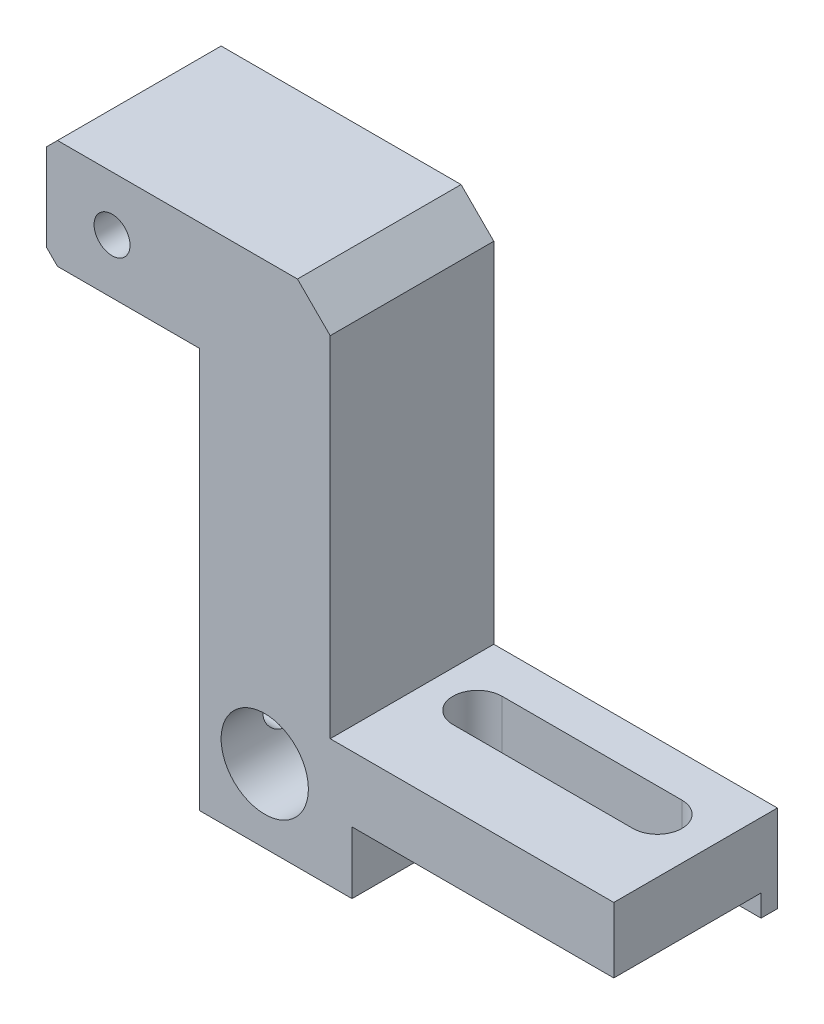
ISO-10303-21;
HEADER;
FILE_DESCRIPTION(('STEP AP214'),'2;1');
FILE_NAME('part.step','',(''),(''),'','','');
FILE_SCHEMA(('AUTOMOTIVE_DESIGN { 1 0 10303 214 1 1 1 1 }'));
ENDSEC;
DATA;
#1=APPLICATION_CONTEXT('core data for automotive mechanical design processes');
#2=APPLICATION_PROTOCOL_DEFINITION('international standard','automotive_design',2000,#1);
#3=PRODUCT_CONTEXT('',#1,'mechanical');
#4=PRODUCT('Part','Part','',(#3));
#5=PRODUCT_RELATED_PRODUCT_CATEGORY('part','',(#4));
#6=PRODUCT_DEFINITION_FORMATION('','',#4);
#7=PRODUCT_DEFINITION_CONTEXT('part definition',#1,'design');
#8=PRODUCT_DEFINITION('design','',#6,#7);
#9=PRODUCT_DEFINITION_SHAPE('','',#8);
#10=(LENGTH_UNIT() NAMED_UNIT(*) SI_UNIT(.MILLI.,.METRE.));
#11=(NAMED_UNIT(*) PLANE_ANGLE_UNIT() SI_UNIT($,.RADIAN.));
#12=(NAMED_UNIT(*) SI_UNIT($,.STERADIAN.) SOLID_ANGLE_UNIT());
#13=UNCERTAINTY_MEASURE_WITH_UNIT(LENGTH_MEASURE(1.E-05),#10,'distance_accuracy_value','');
#14=(GEOMETRIC_REPRESENTATION_CONTEXT(3) GLOBAL_UNCERTAINTY_ASSIGNED_CONTEXT((#13)) GLOBAL_UNIT_ASSIGNED_CONTEXT((#10,
#11,#12)) REPRESENTATION_CONTEXT('',''));
#15=CARTESIAN_POINT('',(0.,0.,0.));
#16=DIRECTION('',(0.,0.,1.));
#17=DIRECTION('',(1.,0.,0.));
#18=AXIS2_PLACEMENT_3D('',#15,#16,#17);
#19=CARTESIAN_POINT('',(32.2857142857143,-33.9081632653061,15.));
#20=DIRECTION('',(0.,1.,0.));
#21=DIRECTION('',(0.,0.,1.));
#22=AXIS2_PLACEMENT_3D('',#19,#20,#21);
#23=PLANE('',#22);
#24=DIRECTION('',(-1.,0.,0.));
#25=VECTOR('',#24,1.);
#26=CARTESIAN_POINT('',(32.2857142857143,-33.9081632653061,3.75));
#27=LINE('',#26,#25);
#28=CARTESIAN_POINT('',(27.2857142857143,-33.9081632653061,3.75));
#29=VERTEX_POINT('',#28);
#30=CARTESIAN_POINT('',(10.7857142857143,-33.9081632653061,3.75000000000001));
#31=VERTEX_POINT('',#30);
#32=EDGE_CURVE('E398',#29,#31,#27,.T.);
#33=ORIENTED_EDGE('',*,*,#32,.T.);
#34=CARTESIAN_POINT('',(10.7857142857143,-33.9081632653061,6.00000000000001));
#35=DIRECTION('',(0.,1.,0.));
#36=DIRECTION('',(0.,0.,1.));
#37=AXIS2_PLACEMENT_3D('',#34,#35,#36);
#38=CIRCLE('',#37,2.25);
#39=CARTESIAN_POINT('',(10.7857142857143,-33.9081632653061,8.25));
#40=VERTEX_POINT('',#39);
#41=EDGE_CURVE('E387',#31,#40,#38,.T.);
#42=ORIENTED_EDGE('',*,*,#41,.T.);
#43=DIRECTION('',(1.,0.,0.));
#44=VECTOR('',#43,1.);
#45=CARTESIAN_POINT('',(32.2857142857143,-33.9081632653061,8.25));
#46=LINE('',#45,#44);
#47=CARTESIAN_POINT('',(27.2857142857143,-33.9081632653061,8.25));
#48=VERTEX_POINT('',#47);
#49=EDGE_CURVE('E403',#40,#48,#46,.T.);
#50=ORIENTED_EDGE('',*,*,#49,.T.);
#51=CARTESIAN_POINT('',(27.2857142857143,-33.9081632653061,6.));
#52=DIRECTION('',(0.,1.,0.));
#53=DIRECTION('',(0.,0.,1.));
#54=AXIS2_PLACEMENT_3D('',#51,#52,#53);
#55=CIRCLE('',#54,2.25);
#56=EDGE_CURVE('E400',#48,#29,#55,.T.);
#57=ORIENTED_EDGE('',*,*,#56,.T.);
#58=EDGE_LOOP('',(#33,#42,#50,#57));
#59=FACE_BOUND('',#58,.T.);
#60=DIRECTION('',(-1.,0.,0.));
#61=VECTOR('',#60,1.);
#62=CARTESIAN_POINT('',(32.2857142857143,-33.9081632653061,1.5));
#63=LINE('',#62,#61);
#64=CARTESIAN_POINT('',(32.2857142857143,-33.9081632653061,1.5));
#65=VERTEX_POINT('',#64);
#66=CARTESIAN_POINT('',(10.2857142857143,-33.9081632653061,1.5));
#67=VERTEX_POINT('',#66);
#68=EDGE_CURVE('E385',#65,#67,#63,.T.);
#69=ORIENTED_EDGE('',*,*,#68,.F.);
#70=DIRECTION('',(0.,0.,-1.));
#71=VECTOR('',#70,1.);
#72=CARTESIAN_POINT('',(32.2857142857143,-33.9081632653061,15.));
#73=LINE('',#72,#71);
#74=CARTESIAN_POINT('',(32.2857142857143,-33.9081632653061,15.));
#75=VERTEX_POINT('',#74);
#76=EDGE_CURVE('E305',#75,#65,#73,.T.);
#77=ORIENTED_EDGE('',*,*,#76,.F.);
#78=DIRECTION('',(1.,0.,0.));
#79=VECTOR('',#78,1.);
#80=CARTESIAN_POINT('',(32.2857142857143,-33.9081632653061,15.));
#81=LINE('',#80,#79);
#82=CARTESIAN_POINT('',(8.2857142857143,-33.9081632653061,15.));
#83=VERTEX_POINT('',#82);
#84=EDGE_CURVE('E362',#83,#75,#81,.T.);
#85=ORIENTED_EDGE('',*,*,#84,.F.);
#86=DIRECTION('',(0.,0.,-1.));
#87=VECTOR('',#86,1.);
#88=CARTESIAN_POINT('',(8.2857142857143,-33.9081632653061,15.));
#89=LINE('',#88,#87);
#90=CARTESIAN_POINT('',(8.2857142857143,-33.9081632653061,0.));
#91=VERTEX_POINT('',#90);
#92=EDGE_CURVE('E308',#83,#91,#89,.T.);
#93=ORIENTED_EDGE('',*,*,#92,.T.);
#94=DIRECTION('',(1.,0.,0.));
#95=VECTOR('',#94,1.);
#96=CARTESIAN_POINT('',(32.2857142857143,-33.9081632653061,0.));
#97=LINE('',#96,#95);
#98=CARTESIAN_POINT('',(10.2857142857143,-33.9081632653061,0.));
#99=VERTEX_POINT('',#98);
#100=EDGE_CURVE('E345',#91,#99,#97,.T.);
#101=ORIENTED_EDGE('',*,*,#100,.T.);
#102=DIRECTION('',(0.,0.,-1.));
#103=VECTOR('',#102,1.);
#104=CARTESIAN_POINT('',(10.2857142857143,-33.9081632653061,0.));
#105=LINE('',#104,#103);
#106=EDGE_CURVE('E382',#67,#99,#105,.T.);
#107=ORIENTED_EDGE('',*,*,#106,.F.);
#108=EDGE_LOOP('',(#69,#77,#85,#93,#101,#107));
#109=FACE_BOUND('',#108,.T.);
#110=ADVANCED_FACE('F35',(#59,#109),#23,.F.);
#111=CARTESIAN_POINT('',(0.,0.,15.));
#112=DIRECTION('',(0.,0.,-1.));
#113=DIRECTION('',(-1.,0.,0.));
#114=AXIS2_PLACEMENT_3D('',#111,#112,#113);
#115=PLANE('',#114);
#116=CARTESIAN_POINT('',(-13.7142857142857,2.09183673469387,15.));
#117=DIRECTION('',(0.,0.,1.));
#118=DIRECTION('',(1.,0.,0.));
#119=AXIS2_PLACEMENT_3D('',#116,#117,#118);
#120=CIRCLE('',#119,1.64999999999999);
#121=CARTESIAN_POINT('',(-12.0642857142857,2.09183673469387,15.));
#122=VERTEX_POINT('',#121);
#123=EDGE_CURVE('E184',#122,#122,#120,.T.);
#124=ORIENTED_EDGE('',*,*,#123,.F.);
#125=EDGE_LOOP('',(#124));
#126=FACE_BOUND('',#125,.T.);
#127=DIRECTION('',(0.,1.,0.));
#128=VECTOR('',#127,1.);
#129=CARTESIAN_POINT('',(6.2857142857143,7.09183673469387,15.));
#130=LINE('',#129,#128);
#131=CARTESIAN_POINT('',(6.2857142857143,-27.9081632653061,15.));
#132=VERTEX_POINT('',#131);
#133=CARTESIAN_POINT('',(6.2857142857143,4.09183673469386,15.));
#134=VERTEX_POINT('',#133);
#135=EDGE_CURVE('E356',#132,#134,#130,.T.);
#136=ORIENTED_EDGE('',*,*,#135,.T.);
#137=DIRECTION('',(0.707106781186547,-0.707106781186548,0.));
#138=VECTOR('',#137,1.);
#139=CARTESIAN_POINT('',(3.28571428571429,7.09183673469387,15.));
#140=LINE('',#139,#138);
#141=CARTESIAN_POINT('',(3.28571428571429,7.09183673469387,15.));
#142=VERTEX_POINT('',#141);
#143=EDGE_CURVE('E11',#134,#142,#140,.F.);
#144=ORIENTED_EDGE('',*,*,#143,.T.);
#145=DIRECTION('',(-1.,0.,0.));
#146=VECTOR('',#145,1.);
#147=CARTESIAN_POINT('',(-19.7142857142857,7.09183673469387,15.));
#148=LINE('',#147,#146);
#149=CARTESIAN_POINT('',(-18.7142857142857,7.09183673469387,15.));
#150=VERTEX_POINT('',#149);
#151=EDGE_CURVE('E285',#142,#150,#148,.T.);
#152=ORIENTED_EDGE('',*,*,#151,.T.);
#153=DIRECTION('',(0.70710678118655,0.707106781186545,0.));
#154=VECTOR('',#153,1.);
#155=CARTESIAN_POINT('',(-19.7142857142857,6.09183673469388,15.));
#156=LINE('',#155,#154);
#157=CARTESIAN_POINT('',(-19.7142857142857,6.09183673469388,15.));
#158=VERTEX_POINT('',#157);
#159=EDGE_CURVE('E260',#150,#158,#156,.F.);
#160=ORIENTED_EDGE('',*,*,#159,.T.);
#161=DIRECTION('',(0.,-1.,0.));
#162=VECTOR('',#161,1.);
#163=CARTESIAN_POINT('',(-19.7142857142857,-2.90816326530613,15.));
#164=LINE('',#163,#162);
#165=CARTESIAN_POINT('',(-19.7142857142857,-1.90816326530613,15.));
#166=VERTEX_POINT('',#165);
#167=EDGE_CURVE('E290',#158,#166,#164,.T.);
#168=ORIENTED_EDGE('',*,*,#167,.T.);
#169=DIRECTION('',(-0.707106781186545,0.70710678118655,0.));
#170=VECTOR('',#169,1.);
#171=CARTESIAN_POINT('',(-18.7142857142857,-2.90816326530613,15.));
#172=LINE('',#171,#170);
#173=CARTESIAN_POINT('',(-18.7142857142857,-2.90816326530613,15.));
#174=VERTEX_POINT('',#173);
#175=EDGE_CURVE('E268',#166,#174,#172,.F.);
#176=ORIENTED_EDGE('',*,*,#175,.T.);
#177=DIRECTION('',(1.,0.,0.));
#178=VECTOR('',#177,1.);
#179=CARTESIAN_POINT('',(-5.7142857142857,-2.90816326530613,15.));
#180=LINE('',#179,#178);
#181=CARTESIAN_POINT('',(-5.7142857142857,-2.90816326530613,15.));
#182=VERTEX_POINT('',#181);
#183=EDGE_CURVE('E293',#174,#182,#180,.T.);
#184=ORIENTED_EDGE('',*,*,#183,.T.);
#185=DIRECTION('',(0.,-1.,0.));
#186=VECTOR('',#185,1.);
#187=CARTESIAN_POINT('',(-5.7142857142857,-39.6081632653061,15.));
#188=LINE('',#187,#186);
#189=CARTESIAN_POINT('',(-5.7142857142857,-39.6081632653061,15.));
#190=VERTEX_POINT('',#189);
#191=EDGE_CURVE('E368',#182,#190,#188,.T.);
#192=ORIENTED_EDGE('',*,*,#191,.T.);
#193=DIRECTION('',(1.,0.,0.));
#194=VECTOR('',#193,1.);
#195=CARTESIAN_POINT('',(8.2857142857143,-39.6081632653061,15.));
#196=LINE('',#195,#194);
#197=CARTESIAN_POINT('',(8.2857142857143,-39.6081632653061,15.));
#198=VERTEX_POINT('',#197);
#199=EDGE_CURVE('E366',#190,#198,#196,.T.);
#200=ORIENTED_EDGE('',*,*,#199,.T.);
#201=DIRECTION('',(0.,1.,0.));
#202=VECTOR('',#201,1.);
#203=CARTESIAN_POINT('',(8.2857142857143,-33.9081632653061,15.));
#204=LINE('',#203,#202);
#205=EDGE_CURVE('E364',#198,#83,#204,.T.);
#206=ORIENTED_EDGE('',*,*,#205,.T.);
#207=ORIENTED_EDGE('',*,*,#84,.T.);
#208=DIRECTION('',(0.,1.,0.));
#209=VECTOR('',#208,1.);
#210=CARTESIAN_POINT('',(32.2857142857143,-27.9081632653061,15.));
#211=LINE('',#210,#209);
#212=CARTESIAN_POINT('',(32.2857142857143,-27.9081632653061,15.));
#213=VERTEX_POINT('',#212);
#214=EDGE_CURVE('E358',#75,#213,#211,.T.);
#215=ORIENTED_EDGE('',*,*,#214,.T.);
#216=DIRECTION('',(-1.,0.,0.));
#217=VECTOR('',#216,1.);
#218=CARTESIAN_POINT('',(6.2857142857143,-27.9081632653061,15.));
#219=LINE('',#218,#217);
#220=EDGE_CURVE('E357',#213,#132,#219,.T.);
#221=ORIENTED_EDGE('',*,*,#220,.T.);
#222=EDGE_LOOP('',(#136,#144,#152,#160,#168,#176,#184,#192,#200,#206,#207,#215,#221));
#223=FACE_BOUND('',#222,.T.);
#224=CARTESIAN_POINT('',(0.285714285714299,-32.9081632653061,15.));
#225=DIRECTION('',(0.,0.,1.));
#226=DIRECTION('',(1.,0.,0.));
#227=AXIS2_PLACEMENT_3D('',#224,#225,#226);
#228=CIRCLE('',#227,4.);
#229=CARTESIAN_POINT('',(4.2857142857143,-32.9081632653061,15.));
#230=VERTEX_POINT('',#229);
#231=EDGE_CURVE('E330',#230,#230,#228,.T.);
#232=ORIENTED_EDGE('',*,*,#231,.F.);
#233=EDGE_LOOP('',(#232));
#234=FACE_BOUND('',#233,.T.);
#235=ADVANCED_FACE('F217',(#126,#223,#234),#115,.F.);
#236=CARTESIAN_POINT('',(0.,0.,0.));
#237=DIRECTION('',(0.,0.,-1.));
#238=DIRECTION('',(-1.,0.,0.));
#239=AXIS2_PLACEMENT_3D('',#236,#237,#238);
#240=PLANE('',#239);
#241=DIRECTION('',(-1.,0.,0.));
#242=VECTOR('',#241,1.);
#243=CARTESIAN_POINT('',(-19.7142857142857,7.09183673469387,0.));
#244=LINE('',#243,#242);
#245=CARTESIAN_POINT('',(3.28571428571429,7.09183673469387,0.));
#246=VERTEX_POINT('',#245);
#247=CARTESIAN_POINT('',(-18.7142857142857,7.09183673469387,0.));
#248=VERTEX_POINT('',#247);
#249=EDGE_CURVE('E283',#246,#248,#244,.T.);
#250=ORIENTED_EDGE('',*,*,#249,.F.);
#251=DIRECTION('',(-0.707106781186547,0.707106781186548,0.));
#252=VECTOR('',#251,1.);
#253=CARTESIAN_POINT('',(5.18877551020408,5.18877551020408,0.));
#254=LINE('',#253,#252);
#255=CARTESIAN_POINT('',(6.2857142857143,4.09183673469386,0.));
#256=VERTEX_POINT('',#255);
#257=EDGE_CURVE('E57',#246,#256,#254,.F.);
#258=ORIENTED_EDGE('',*,*,#257,.T.);
#259=DIRECTION('',(0.,1.,0.));
#260=VECTOR('',#259,1.);
#261=CARTESIAN_POINT('',(6.2857142857143,7.09183673469387,0.));
#262=LINE('',#261,#260);
#263=CARTESIAN_POINT('',(6.2857142857143,-27.9081632653061,0.));
#264=VERTEX_POINT('',#263);
#265=EDGE_CURVE('E291',#264,#256,#262,.T.);
#266=ORIENTED_EDGE('',*,*,#265,.F.);
#267=DIRECTION('',(-1.,0.,0.));
#268=VECTOR('',#267,1.);
#269=CARTESIAN_POINT('',(6.2857142857143,-27.9081632653061,0.));
#270=LINE('',#269,#268);
#271=CARTESIAN_POINT('',(32.2857142857143,-27.9081632653061,0.));
#272=VERTEX_POINT('',#271);
#273=EDGE_CURVE('E295',#272,#264,#270,.T.);
#274=ORIENTED_EDGE('',*,*,#273,.F.);
#275=DIRECTION('',(0.,1.,0.));
#276=VECTOR('',#275,1.);
#277=CARTESIAN_POINT('',(32.2857142857143,-27.9081632653061,0.));
#278=LINE('',#277,#276);
#279=CARTESIAN_POINT('',(32.2857142857143,-35.9081632653061,0.));
#280=VERTEX_POINT('',#279);
#281=EDGE_CURVE('E348',#280,#272,#278,.T.);
#282=ORIENTED_EDGE('',*,*,#281,.F.);
#283=DIRECTION('',(1.,0.,0.));
#284=VECTOR('',#283,1.);
#285=CARTESIAN_POINT('',(32.2857142857143,-35.9081632653061,0.));
#286=LINE('',#285,#284);
#287=CARTESIAN_POINT('',(10.2857142857143,-35.9081632653061,0.));
#288=VERTEX_POINT('',#287);
#289=EDGE_CURVE('E381',#288,#280,#286,.T.);
#290=ORIENTED_EDGE('',*,*,#289,.F.);
#291=DIRECTION('',(0.,1.,0.));
#292=VECTOR('',#291,1.);
#293=CARTESIAN_POINT('',(10.2857142857143,-35.9081632653061,0.));
#294=LINE('',#293,#292);
#295=EDGE_CURVE('E378',#288,#99,#294,.T.);
#296=ORIENTED_EDGE('',*,*,#295,.T.);
#297=ORIENTED_EDGE('',*,*,#100,.F.);
#298=DIRECTION('',(0.,1.,0.));
#299=VECTOR('',#298,1.);
#300=CARTESIAN_POINT('',(8.2857142857143,-33.9081632653061,0.));
#301=LINE('',#300,#299);
#302=CARTESIAN_POINT('',(8.2857142857143,-39.6081632653061,0.));
#303=VERTEX_POINT('',#302);
#304=EDGE_CURVE('E343',#303,#91,#301,.T.);
#305=ORIENTED_EDGE('',*,*,#304,.F.);
#306=DIRECTION('',(1.,0.,0.));
#307=VECTOR('',#306,1.);
#308=CARTESIAN_POINT('',(8.2857142857143,-39.6081632653061,0.));
#309=LINE('',#308,#307);
#310=CARTESIAN_POINT('',(-5.7142857142857,-39.6081632653061,0.));
#311=VERTEX_POINT('',#310);
#312=EDGE_CURVE('E341',#311,#303,#309,.T.);
#313=ORIENTED_EDGE('',*,*,#312,.F.);
#314=DIRECTION('',(0.,-1.,0.));
#315=VECTOR('',#314,1.);
#316=CARTESIAN_POINT('',(-5.7142857142857,-39.6081632653061,0.));
#317=LINE('',#316,#315);
#318=CARTESIAN_POINT('',(-5.7142857142857,-2.90816326530613,0.));
#319=VERTEX_POINT('',#318);
#320=EDGE_CURVE('E332',#319,#311,#317,.T.);
#321=ORIENTED_EDGE('',*,*,#320,.F.);
#322=DIRECTION('',(1.,0.,0.));
#323=VECTOR('',#322,1.);
#324=CARTESIAN_POINT('',(-5.7142857142857,-2.90816326530613,0.));
#325=LINE('',#324,#323);
#326=CARTESIAN_POINT('',(-18.7142857142857,-2.90816326530613,0.));
#327=VERTEX_POINT('',#326);
#328=EDGE_CURVE('E329',#327,#319,#325,.T.);
#329=ORIENTED_EDGE('',*,*,#328,.F.);
#330=DIRECTION('',(0.707106781186545,-0.70710678118655,0.));
#331=VECTOR('',#330,1.);
#332=CARTESIAN_POINT('',(-10.811224489796,-10.8112244897959,0.));
#333=LINE('',#332,#331);
#334=CARTESIAN_POINT('',(-19.7142857142857,-1.90816326530613,0.));
#335=VERTEX_POINT('',#334);
#336=EDGE_CURVE('E324',#327,#335,#333,.F.);
#337=ORIENTED_EDGE('',*,*,#336,.T.);
#338=DIRECTION('',(0.,-1.,0.));
#339=VECTOR('',#338,1.);
#340=CARTESIAN_POINT('',(-19.7142857142857,-2.90816326530613,0.));
#341=LINE('',#340,#339);
#342=CARTESIAN_POINT('',(-19.7142857142857,6.09183673469388,0.));
#343=VERTEX_POINT('',#342);
#344=EDGE_CURVE('E326',#343,#335,#341,.T.);
#345=ORIENTED_EDGE('',*,*,#344,.F.);
#346=DIRECTION('',(-0.70710678118655,-0.707106781186545,0.));
#347=VECTOR('',#346,1.);
#348=CARTESIAN_POINT('',(-12.9030612244897,12.9030612244898,0.));
#349=LINE('',#348,#347);
#350=EDGE_CURVE('E289',#343,#248,#349,.F.);
#351=ORIENTED_EDGE('',*,*,#350,.T.);
#352=EDGE_LOOP('',(#250,#258,#266,#274,#282,#290,#296,#297,#305,#313,#321,#329,#337,#345,#351));
#353=FACE_BOUND('',#352,.T.);
#354=CARTESIAN_POINT('',(0.285714285714299,-32.9081632653061,0.));
#355=DIRECTION('',(0.,0.,1.));
#356=DIRECTION('',(1.,0.,0.));
#357=AXIS2_PLACEMENT_3D('',#354,#355,#356);
#358=CIRCLE('',#357,4.);
#359=CARTESIAN_POINT('',(4.2857142857143,-32.9081632653061,0.));
#360=VERTEX_POINT('',#359);
#361=EDGE_CURVE('E335',#360,#360,#358,.T.);
#362=ORIENTED_EDGE('',*,*,#361,.T.);
#363=EDGE_LOOP('',(#362));
#364=FACE_BOUND('',#363,.T.);
#365=ADVANCED_FACE('F223',(#353,#364),#240,.T.);
#366=CARTESIAN_POINT('',(-19.7142857142857,-2.90816326530613,15.));
#367=DIRECTION('',(1.,0.,0.));
#368=DIRECTION('',(0.,0.,-1.));
#369=AXIS2_PLACEMENT_3D('',#366,#367,#368);
#370=PLANE('',#369);
#371=ORIENTED_EDGE('',*,*,#344,.T.);
#372=DIRECTION('',(0.,0.,1.));
#373=VECTOR('',#372,1.);
#374=CARTESIAN_POINT('',(-19.7142857142857,-1.90816326530613,15.));
#375=LINE('',#374,#373);
#376=EDGE_CURVE('E269',#335,#166,#375,.T.);
#377=ORIENTED_EDGE('',*,*,#376,.T.);
#378=ORIENTED_EDGE('',*,*,#167,.F.);
#379=DIRECTION('',(0.,0.,-1.));
#380=VECTOR('',#379,1.);
#381=CARTESIAN_POINT('',(-19.7142857142857,6.09183673469388,15.));
#382=LINE('',#381,#380);
#383=EDGE_CURVE('E264',#158,#343,#382,.T.);
#384=ORIENTED_EDGE('',*,*,#383,.T.);
#385=EDGE_LOOP('',(#371,#377,#378,#384));
#386=FACE_BOUND('',#385,.T.);
#387=ADVANCED_FACE('F247',(#386),#370,.F.);
#388=CARTESIAN_POINT('',(-5.7142857142857,-2.90816326530613,15.));
#389=DIRECTION('',(0.,1.,0.));
#390=DIRECTION('',(-1.,0.,0.));
#391=AXIS2_PLACEMENT_3D('',#388,#389,#390);
#392=PLANE('',#391);
#393=ORIENTED_EDGE('',*,*,#183,.F.);
#394=DIRECTION('',(0.,0.,-1.));
#395=VECTOR('',#394,1.);
#396=CARTESIAN_POINT('',(-18.7142857142857,-2.90816326530613,15.));
#397=LINE('',#396,#395);
#398=EDGE_CURVE('E320',#174,#327,#397,.T.);
#399=ORIENTED_EDGE('',*,*,#398,.T.);
#400=ORIENTED_EDGE('',*,*,#328,.T.);
#401=DIRECTION('',(0.,0.,-1.));
#402=VECTOR('',#401,1.);
#403=CARTESIAN_POINT('',(-5.7142857142857,-2.90816326530613,15.));
#404=LINE('',#403,#402);
#405=EDGE_CURVE('E317',#182,#319,#404,.T.);
#406=ORIENTED_EDGE('',*,*,#405,.F.);
#407=EDGE_LOOP('',(#393,#399,#400,#406));
#408=FACE_BOUND('',#407,.T.);
#409=ADVANCED_FACE('F243',(#408),#392,.F.);
#410=CARTESIAN_POINT('',(-5.7142857142857,-39.6081632653061,15.));
#411=DIRECTION('',(1.,0.,0.));
#412=DIRECTION('',(0.,1.,0.));
#413=AXIS2_PLACEMENT_3D('',#410,#411,#412);
#414=PLANE('',#413);
#415=CARTESIAN_POINT('',(-5.7142857142857,-32.9081632653061,9.5));
#416=DIRECTION('',(-1.,0.,0.));
#417=DIRECTION('',(0.,0.,1.));
#418=AXIS2_PLACEMENT_3D('',#415,#416,#417);
#419=CIRCLE('',#418,1.64999999999998);
#420=CARTESIAN_POINT('',(-5.7142857142857,-32.9081632653061,11.15));
#421=VERTEX_POINT('',#420);
#422=EDGE_CURVE('E183',#421,#421,#419,.T.);
#423=ORIENTED_EDGE('',*,*,#422,.F.);
#424=EDGE_LOOP('',(#423));
#425=FACE_BOUND('',#424,.T.);
#426=ORIENTED_EDGE('',*,*,#320,.T.);
#427=DIRECTION('',(0.,0.,-1.));
#428=VECTOR('',#427,1.);
#429=CARTESIAN_POINT('',(-5.7142857142857,-39.6081632653061,15.));
#430=LINE('',#429,#428);
#431=EDGE_CURVE('E314',#190,#311,#430,.T.);
#432=ORIENTED_EDGE('',*,*,#431,.F.);
#433=ORIENTED_EDGE('',*,*,#191,.F.);
#434=ORIENTED_EDGE('',*,*,#405,.T.);
#435=EDGE_LOOP('',(#426,#432,#433,#434));
#436=FACE_BOUND('',#435,.T.);
#437=ADVANCED_FACE('F239',(#425,#436),#414,.F.);
#438=CARTESIAN_POINT('',(8.2857142857143,-39.6081632653061,15.));
#439=DIRECTION('',(0.,1.,0.));
#440=DIRECTION('',(0.,0.,1.));
#441=AXIS2_PLACEMENT_3D('',#438,#439,#440);
#442=PLANE('',#441);
#443=ORIENTED_EDGE('',*,*,#312,.T.);
#444=DIRECTION('',(0.,0.,-1.));
#445=VECTOR('',#444,1.);
#446=CARTESIAN_POINT('',(8.2857142857143,-39.6081632653061,15.));
#447=LINE('',#446,#445);
#448=EDGE_CURVE('E311',#198,#303,#447,.T.);
#449=ORIENTED_EDGE('',*,*,#448,.F.);
#450=ORIENTED_EDGE('',*,*,#199,.F.);
#451=ORIENTED_EDGE('',*,*,#431,.T.);
#452=EDGE_LOOP('',(#443,#449,#450,#451));
#453=FACE_BOUND('',#452,.T.);
#454=ADVANCED_FACE('F235',(#453),#442,.F.);
#455=CARTESIAN_POINT('',(8.2857142857143,-33.9081632653061,15.));
#456=DIRECTION('',(-1.,0.,0.));
#457=DIRECTION('',(0.,0.,1.));
#458=AXIS2_PLACEMENT_3D('',#455,#456,#457);
#459=PLANE('',#458);
#460=ORIENTED_EDGE('',*,*,#304,.T.);
#461=ORIENTED_EDGE('',*,*,#92,.F.);
#462=ORIENTED_EDGE('',*,*,#205,.F.);
#463=ORIENTED_EDGE('',*,*,#448,.T.);
#464=EDGE_LOOP('',(#460,#461,#462,#463));
#465=FACE_BOUND('',#464,.T.);
#466=ADVANCED_FACE('F232',(#465),#459,.F.);
#467=CARTESIAN_POINT('',(32.2857142857143,-27.9081632653061,15.));
#468=DIRECTION('',(-1.,0.,0.));
#469=DIRECTION('',(0.,0.,1.));
#470=AXIS2_PLACEMENT_3D('',#467,#468,#469);
#471=PLANE('',#470);
#472=ORIENTED_EDGE('',*,*,#281,.T.);
#473=DIRECTION('',(0.,0.,-1.));
#474=VECTOR('',#473,1.);
#475=CARTESIAN_POINT('',(32.2857142857143,-27.9081632653061,15.));
#476=LINE('',#475,#474);
#477=EDGE_CURVE('E302',#213,#272,#476,.T.);
#478=ORIENTED_EDGE('',*,*,#477,.F.);
#479=ORIENTED_EDGE('',*,*,#214,.F.);
#480=ORIENTED_EDGE('',*,*,#76,.T.);
#481=DIRECTION('',(0.,1.,0.));
#482=VECTOR('',#481,1.);
#483=CARTESIAN_POINT('',(32.2857142857143,-35.9081632653061,1.5));
#484=LINE('',#483,#482);
#485=CARTESIAN_POINT('',(32.2857142857143,-35.9081632653061,1.5));
#486=VERTEX_POINT('',#485);
#487=EDGE_CURVE('E372',#486,#65,#484,.T.);
#488=ORIENTED_EDGE('',*,*,#487,.F.);
#489=DIRECTION('',(0.,0.,1.));
#490=VECTOR('',#489,1.);
#491=CARTESIAN_POINT('',(32.2857142857143,-35.9081632653061,0.));
#492=LINE('',#491,#490);
#493=EDGE_CURVE('E384',#280,#486,#492,.T.);
#494=ORIENTED_EDGE('',*,*,#493,.F.);
#495=EDGE_LOOP('',(#472,#478,#479,#480,#488,#494));
#496=FACE_BOUND('',#495,.T.);
#497=ADVANCED_FACE('F230',(#496),#471,.F.);
#498=CARTESIAN_POINT('',(6.2857142857143,-27.9081632653061,15.));
#499=DIRECTION('',(0.,-1.,0.));
#500=DIRECTION('',(0.,0.,-1.));
#501=AXIS2_PLACEMENT_3D('',#498,#499,#500);
#502=PLANE('',#501);
#503=DIRECTION('',(1.,0.,0.));
#504=VECTOR('',#503,1.);
#505=CARTESIAN_POINT('',(10.7857142857143,-27.9081632653061,8.25));
#506=LINE('',#505,#504);
#507=CARTESIAN_POINT('',(10.7857142857143,-27.9081632653061,8.25));
#508=VERTEX_POINT('',#507);
#509=CARTESIAN_POINT('',(27.2857142857143,-27.9081632653061,8.25));
#510=VERTEX_POINT('',#509);
#511=EDGE_CURVE('E420',#508,#510,#506,.T.);
#512=ORIENTED_EDGE('',*,*,#511,.F.);
#513=CARTESIAN_POINT('',(10.7857142857143,-27.9081632653061,6.00000000000001));
#514=DIRECTION('',(0.,1.,0.));
#515=DIRECTION('',(0.,0.,1.));
#516=AXIS2_PLACEMENT_3D('',#513,#514,#515);
#517=CIRCLE('',#516,2.25);
#518=CARTESIAN_POINT('',(10.7857142857143,-27.9081632653061,3.75000000000001));
#519=VERTEX_POINT('',#518);
#520=EDGE_CURVE('E198',#519,#508,#517,.T.);
#521=ORIENTED_EDGE('',*,*,#520,.F.);
#522=DIRECTION('',(-1.,0.,0.));
#523=VECTOR('',#522,1.);
#524=CARTESIAN_POINT('',(10.7857142857143,-27.9081632653061,3.75000000000001));
#525=LINE('',#524,#523);
#526=CARTESIAN_POINT('',(27.2857142857143,-27.9081632653061,3.75));
#527=VERTEX_POINT('',#526);
#528=EDGE_CURVE('E411',#527,#519,#525,.T.);
#529=ORIENTED_EDGE('',*,*,#528,.F.);
#530=CARTESIAN_POINT('',(27.2857142857143,-27.9081632653061,6.));
#531=DIRECTION('',(0.,1.,0.));
#532=DIRECTION('',(0.,0.,1.));
#533=AXIS2_PLACEMENT_3D('',#530,#531,#532);
#534=CIRCLE('',#533,2.25);
#535=EDGE_CURVE('E418',#510,#527,#534,.T.);
#536=ORIENTED_EDGE('',*,*,#535,.F.);
#537=EDGE_LOOP('',(#512,#521,#529,#536));
#538=FACE_BOUND('',#537,.T.);
#539=ORIENTED_EDGE('',*,*,#273,.T.);
#540=DIRECTION('',(0.,0.,-1.));
#541=VECTOR('',#540,1.);
#542=CARTESIAN_POINT('',(6.2857142857143,-27.9081632653061,15.));
#543=LINE('',#542,#541);
#544=EDGE_CURVE('E299',#132,#264,#543,.T.);
#545=ORIENTED_EDGE('',*,*,#544,.F.);
#546=ORIENTED_EDGE('',*,*,#220,.F.);
#547=ORIENTED_EDGE('',*,*,#477,.T.);
#548=EDGE_LOOP('',(#539,#545,#546,#547));
#549=FACE_BOUND('',#548,.T.);
#550=ADVANCED_FACE('F352',(#538,#549),#502,.F.);
#551=CARTESIAN_POINT('',(6.2857142857143,7.09183673469387,15.));
#552=DIRECTION('',(-1.,0.,0.));
#553=DIRECTION('',(0.,-1.,0.));
#554=AXIS2_PLACEMENT_3D('',#551,#552,#553);
#555=PLANE('',#554);
#556=ORIENTED_EDGE('',*,*,#265,.T.);
#557=DIRECTION('',(0.,0.,1.));
#558=VECTOR('',#557,1.);
#559=CARTESIAN_POINT('',(6.2857142857143,4.09183673469386,15.));
#560=LINE('',#559,#558);
#561=EDGE_CURVE('E43',#256,#134,#560,.T.);
#562=ORIENTED_EDGE('',*,*,#561,.T.);
#563=ORIENTED_EDGE('',*,*,#135,.F.);
#564=ORIENTED_EDGE('',*,*,#544,.T.);
#565=EDGE_LOOP('',(#556,#562,#563,#564));
#566=FACE_BOUND('',#565,.T.);
#567=ADVANCED_FACE('F355',(#566),#555,.F.);
#568=CARTESIAN_POINT('',(-19.7142857142857,7.09183673469387,15.));
#569=DIRECTION('',(0.,-1.,0.));
#570=DIRECTION('',(1.,0.,0.));
#571=AXIS2_PLACEMENT_3D('',#568,#569,#570);
#572=PLANE('',#571);
#573=ORIENTED_EDGE('',*,*,#151,.F.);
#574=DIRECTION('',(0.,0.,-1.));
#575=VECTOR('',#574,1.);
#576=CARTESIAN_POINT('',(3.28571428571429,7.09183673469387,15.));
#577=LINE('',#576,#575);
#578=EDGE_CURVE('E276',#142,#246,#577,.T.);
#579=ORIENTED_EDGE('',*,*,#578,.T.);
#580=ORIENTED_EDGE('',*,*,#249,.T.);
#581=DIRECTION('',(0.,0.,1.));
#582=VECTOR('',#581,1.);
#583=CARTESIAN_POINT('',(-18.7142857142857,7.09183673469387,15.));
#584=LINE('',#583,#582);
#585=EDGE_CURVE('E262',#248,#150,#584,.T.);
#586=ORIENTED_EDGE('',*,*,#585,.T.);
#587=EDGE_LOOP('',(#573,#579,#580,#586));
#588=FACE_BOUND('',#587,.T.);
#589=ADVANCED_FACE('F282',(#588),#572,.F.);
#590=CARTESIAN_POINT('',(0.285714285714299,-32.9081632653061,15.));
#591=DIRECTION('',(0.,0.,-1.));
#592=DIRECTION('',(-1.,0.,0.));
#593=AXIS2_PLACEMENT_3D('',#590,#591,#592);
#594=CYLINDRICAL_SURFACE('',#593,4.);
#595=CARTESIAN_POINT('',(-3.7142857142857,-32.9081632653061,11.15));
#596=CARTESIAN_POINT('',(-3.71427881245644,-32.9966229436694,11.1499907827934));
#597=CARTESIAN_POINT('',(-3.71131717220742,-33.0852255173637,11.1428439856567));
#598=CARTESIAN_POINT('',(-3.69975684631121,-33.2599229351425,11.1145088580631));
#599=CARTESIAN_POINT('',(-3.69114329196177,-33.3460105373031,11.0932834889757));
#600=CARTESIAN_POINT('',(-3.66920536958506,-33.5128657622089,11.0377051877981));
#601=CARTESIAN_POINT('',(-3.65589683826781,-33.5936501997973,11.0033963566465));
#602=CARTESIAN_POINT('',(-3.62586857715102,-33.7482398985296,10.9228052421506));
#603=CARTESIAN_POINT('',(-3.60914991891815,-33.8220473414237,10.8765267188298));
#604=CARTESIAN_POINT('',(-3.57305471440719,-33.9643509612914,10.7708932453559));
#605=CARTESIAN_POINT('',(-3.55359225815828,-34.0324570048809,10.711042329751));
#606=CARTESIAN_POINT('',(-3.51458054775669,-34.1579990091537,10.581011160341));
#607=CARTESIAN_POINT('',(-3.49503125405193,-34.2154294545757,10.5108256007882));
#608=CARTESIAN_POINT('',(-3.45701123114637,-34.3207115333966,10.3580317511283));
#609=CARTESIAN_POINT('',(-3.43863731086663,-34.3679710832117,10.2749888846935));
#610=CARTESIAN_POINT('',(-3.40640707518957,-34.4476768473002,10.1012636907098));
#611=CARTESIAN_POINT('',(-3.39254847937685,-34.480130542434,10.010585248637));
#612=CARTESIAN_POINT('',(-3.37184593300193,-34.527700647531,9.82865200299816));
#613=CARTESIAN_POINT('',(-3.36470020531807,-34.5435669794777,9.73762892785692));
#614=CARTESIAN_POINT('',(-3.35736286224273,-34.5598524465141,9.55395349263471));
#615=CARTESIAN_POINT('',(-3.35716752001309,-34.5602798600461,9.46130203237069));
#616=CARTESIAN_POINT('',(-3.36349710008175,-34.5462410731044,9.28440111338127));
#617=CARTESIAN_POINT('',(-3.36952011169611,-34.5328872501807,9.20004184125083));
#618=CARTESIAN_POINT('',(-3.38676103680408,-34.4935281076181,9.03488971561882));
#619=CARTESIAN_POINT('',(-3.3979799221243,-34.467520421178,8.9540975323967));
#620=CARTESIAN_POINT('',(-3.42460029910002,-34.403087394731,8.79635489124137));
#621=CARTESIAN_POINT('',(-3.44008494612762,-34.3644119350363,8.71952126219166));
#622=CARTESIAN_POINT('',(-3.47347187665477,-34.2759177197424,8.57313976753996));
#623=CARTESIAN_POINT('',(-3.49137510155456,-34.2260946200877,8.50359475775084));
#624=CARTESIAN_POINT('',(-3.52938313824665,-34.1118823845548,8.36771359221219));
#625=CARTESIAN_POINT('',(-3.5495475968226,-34.04662956625,8.30211804229674));
#626=CARTESIAN_POINT('',(-3.58855482035923,-33.9058458201723,8.18255532555862));
#627=CARTESIAN_POINT('',(-3.607397287181,-33.8303125851535,8.12859077613916));
#628=CARTESIAN_POINT('',(-3.64216503700308,-33.6688996350434,8.03276522641496));
#629=CARTESIAN_POINT('',(-3.65801622145362,-33.5828273593784,7.99119971680583));
#630=CARTESIAN_POINT('',(-3.68444891245176,-33.4040915188591,7.92339697589113));
#631=CARTESIAN_POINT('',(-3.69503327122324,-33.3114315526785,7.89715144678884));
#632=CARTESIAN_POINT('',(-3.70921022066505,-33.1283445696238,7.86227049632178));
#633=CARTESIAN_POINT('',(-3.71319692574886,-33.0381374376143,7.85264082206407));
#634=CARTESIAN_POINT('',(-3.71498317855355,-32.8573158251539,7.84830795623671));
#635=CARTESIAN_POINT('',(-3.71278445799914,-32.7667014658055,7.85360058689179));
#636=CARTESIAN_POINT('',(-3.70270318512417,-32.5922555098186,7.87824526824297));
#637=CARTESIAN_POINT('',(-3.6951010311738,-32.5083079477794,7.8969040733401));
#638=CARTESIAN_POINT('',(-3.67527459231661,-32.3448227919765,7.94679209633712));
#639=CARTESIAN_POINT('',(-3.66304972072902,-32.265285759434,7.9780229098148));
#640=CARTESIAN_POINT('',(-3.63468300312034,-32.1101012893416,8.05318937998091));
#641=CARTESIAN_POINT('',(-3.61843157059426,-32.0346506086456,8.09748856175623));
#642=CARTESIAN_POINT('',(-3.58375339616118,-31.891984792097,8.19713393425788));
#643=CARTESIAN_POINT('',(-3.56532575562968,-31.824773081885,8.25248469508985));
#644=CARTESIAN_POINT('',(-3.5266886727311,-31.6955433223787,8.37720430481199));
#645=CARTESIAN_POINT('',(-3.50644487922402,-31.6342196196879,8.44728382403931));
#646=CARTESIAN_POINT('',(-3.46762500369401,-31.5240149104811,8.59707129060854));
#647=CARTESIAN_POINT('',(-3.44904927332679,-31.4751365236789,8.67678125994256));
#648=CARTESIAN_POINT('',(-3.41557271768413,-31.3907404423923,8.84509537053332));
#649=CARTESIAN_POINT('',(-3.40072295853066,-31.3554052359408,8.93380191600807));
#650=CARTESIAN_POINT('',(-3.37710211596752,-31.3004670836522,9.11670916597825));
#651=CARTESIAN_POINT('',(-3.36832615553506,-31.2808515135586,9.21090539641818));
#652=CARTESIAN_POINT('',(-3.3585813079381,-31.2591520259035,9.39443027315808));
#653=CARTESIAN_POINT('',(-3.35707145010094,-31.2558527716649,9.48358721945795));
#654=CARTESIAN_POINT('',(-3.36059749667474,-31.2636484117405,9.66112847075919));
#655=CARTESIAN_POINT('',(-3.36563244321267,-31.2747411996888,9.74951288691938));
#656=CARTESIAN_POINT('',(-3.3811906184727,-31.3099920852404,9.9189330712577));
#657=CARTESIAN_POINT('',(-3.39145832628821,-31.3335436809316,10.0001207114221));
#658=CARTESIAN_POINT('',(-3.41612982635155,-31.3924572705769,10.1574145224741));
#659=CARTESIAN_POINT('',(-3.43053477580741,-31.4278225693372,10.2335192642976));
#660=CARTESIAN_POINT('',(-3.46291980323731,-31.5117826427682,10.3834220382414));
#661=CARTESIAN_POINT('',(-3.48106149282573,-31.5610388293134,10.4568140710214));
#662=CARTESIAN_POINT('',(-3.5184143606528,-31.6704460839279,10.5946716872643));
#663=CARTESIAN_POINT('',(-3.53762589623627,-31.7306008075765,10.6591342627744));
#664=CARTESIAN_POINT('',(-3.57658743441759,-31.8651558777487,10.7819941387037));
#665=CARTESIAN_POINT('',(-3.59627930787797,-31.940263154576,10.8396392236055));
#666=CARTESIAN_POINT('',(-3.6326099833415,-32.0998198021241,10.9415401595387));
#667=CARTESIAN_POINT('',(-3.6492473875125,-32.1842734218633,10.9857898863659));
#668=CARTESIAN_POINT('',(-3.67734262822697,-32.3587485051965,11.0586637398347));
#669=CARTESIAN_POINT('',(-3.68888426850383,-32.4486498836567,11.0875424253585));
#670=CARTESIAN_POINT('',(-3.70583010204046,-32.6324440360929,11.1295110847851));
#671=CARTESIAN_POINT('',(-3.71125357578146,-32.7263232984881,11.1426506662454));
#672=CARTESIAN_POINT('',(-3.71396766055408,-32.8497189700789,11.14922677033));
#673=CARTESIAN_POINT('',(-3.71428799487409,-32.8789333166358,11.1500030456642));
#674=CARTESIAN_POINT('',(-3.7142857142857,-32.9081632653061,11.15));
#675=B_SPLINE_CURVE_WITH_KNOTS('',3,(#595,#596,#597,#598,#599,#600,#601,#602,#603,#604,#605,
#606,#607,#608,#609,#610,#611,#612,#613,#614,#615,#616,#617,#618,#619,#620,#621,#622,#623,#624,
#625,#626,#627,#628,#629,#630,#631,#632,#633,#634,#635,#636,#637,#638,#639,#640,#641,#642,#643,
#644,#645,#646,#647,#648,#649,#650,#651,#652,#653,#654,#655,#656,#657,#658,#659,#660,#661,#662,
#663,#664,#665,#666,#667,#668,#669,#670,#671,#672,#673,#674),.UNSPECIFIED.,.T.,.F.,(4,2,2,2,2,2,
2,2,2,2,2,2,2,2,2,2,2,2,2,2,2,2,2,2,2,2,2,2,2,2,2,2,2,2,2,2,2,2,2,4),(0.,0.265297098770629,
0.531294937906664,0.79640398149889,1.06142984766523,1.33841878994457,1.61555043582129,
1.90598404924537,2.19627075414925,2.47277648539421,2.7491339503796,3.00480633611683,
3.2605265616686,3.52163539301341,3.78284615202014,4.06565185095455,4.34852112528508,
4.63767392136374,4.92666995726767,5.19768149557685,5.46861716672805,5.72643264660553,
5.98428085748384,6.25011488704506,6.51605907418432,6.80064580250401,7.08529238632157,
7.3736498522578,7.66177550895674,7.92807823226722,8.19434198489783,8.44869772098558,
8.70312467109943,8.97267479984707,9.24231550885212,9.53104085816541,9.81989801073177,
10.1038095613048,10.3868238858898,10.4744866574817),.UNSPECIFIED.);
#676=CARTESIAN_POINT('',(-3.7142857142857,-32.9081632653061,11.15));
#677=VERTEX_POINT('',#676);
#678=EDGE_CURVE('E187',#677,#677,#675,.T.);
#679=ORIENTED_EDGE('',*,*,#678,.F.);
#680=EDGE_LOOP('',(#679));
#681=FACE_BOUND('',#680,.T.);
#682=ORIENTED_EDGE('',*,*,#231,.T.);
#683=EDGE_LOOP('',(#682));
#684=FACE_BOUND('',#683,.T.);
#685=ORIENTED_EDGE('',*,*,#361,.F.);
#686=EDGE_LOOP('',(#685));
#687=FACE_BOUND('',#686,.T.);
#688=ADVANCED_FACE('F459',(#681,#684,#687),#594,.F.);
#689=CARTESIAN_POINT('',(32.2857142857143,-35.9081632653061,1.5));
#690=DIRECTION('',(0.,0.,-1.));
#691=DIRECTION('',(-1.,0.,0.));
#692=AXIS2_PLACEMENT_3D('',#689,#690,#691);
#693=PLANE('',#692);
#694=ORIENTED_EDGE('',*,*,#68,.T.);
#695=DIRECTION('',(0.,1.,0.));
#696=VECTOR('',#695,1.);
#697=CARTESIAN_POINT('',(10.2857142857143,-35.9081632653061,1.5));
#698=LINE('',#697,#696);
#699=CARTESIAN_POINT('',(10.2857142857143,-35.9081632653061,1.5));
#700=VERTEX_POINT('',#699);
#701=EDGE_CURVE('E375',#700,#67,#698,.T.);
#702=ORIENTED_EDGE('',*,*,#701,.F.);
#703=DIRECTION('',(-1.,0.,0.));
#704=VECTOR('',#703,1.);
#705=CARTESIAN_POINT('',(32.2857142857143,-35.9081632653061,1.5));
#706=LINE('',#705,#704);
#707=EDGE_CURVE('E392',#486,#700,#706,.T.);
#708=ORIENTED_EDGE('',*,*,#707,.F.);
#709=ORIENTED_EDGE('',*,*,#487,.T.);
#710=EDGE_LOOP('',(#694,#702,#708,#709));
#711=FACE_BOUND('',#710,.T.);
#712=ADVANCED_FACE('F455',(#711),#693,.F.);
#713=CARTESIAN_POINT('',(10.2857142857143,-35.9081632653061,0.));
#714=DIRECTION('',(1.,0.,0.));
#715=DIRECTION('',(0.,0.,-1.));
#716=AXIS2_PLACEMENT_3D('',#713,#714,#715);
#717=PLANE('',#716);
#718=ORIENTED_EDGE('',*,*,#106,.T.);
#719=ORIENTED_EDGE('',*,*,#295,.F.);
#720=DIRECTION('',(0.,0.,-1.));
#721=VECTOR('',#720,1.);
#722=CARTESIAN_POINT('',(10.2857142857143,-35.9081632653061,0.));
#723=LINE('',#722,#721);
#724=EDGE_CURVE('E390',#700,#288,#723,.T.);
#725=ORIENTED_EDGE('',*,*,#724,.F.);
#726=ORIENTED_EDGE('',*,*,#701,.T.);
#727=EDGE_LOOP('',(#718,#719,#725,#726));
#728=FACE_BOUND('',#727,.T.);
#729=ADVANCED_FACE('F451',(#728),#717,.F.);
#730=CARTESIAN_POINT('',(0.,-35.9081632653061,0.));
#731=DIRECTION('',(0.,-1.,0.));
#732=DIRECTION('',(0.,0.,-1.));
#733=AXIS2_PLACEMENT_3D('',#730,#731,#732);
#734=PLANE('',#733);
#735=ORIENTED_EDGE('',*,*,#493,.T.);
#736=ORIENTED_EDGE('',*,*,#707,.T.);
#737=ORIENTED_EDGE('',*,*,#724,.T.);
#738=ORIENTED_EDGE('',*,*,#289,.T.);
#739=EDGE_LOOP('',(#735,#736,#737,#738));
#740=FACE_BOUND('',#739,.T.);
#741=ADVANCED_FACE('F444',(#740),#734,.T.);
#742=CARTESIAN_POINT('',(10.7857142857143,-39.6081632653061,6.00000000000001));
#743=DIRECTION('',(0.,1.,0.));
#744=DIRECTION('',(0.,0.,1.));
#745=AXIS2_PLACEMENT_3D('',#742,#743,#744);
#746=CYLINDRICAL_SURFACE('',#745,2.25);
#747=DIRECTION('',(0.,1.,0.));
#748=VECTOR('',#747,1.);
#749=CARTESIAN_POINT('',(10.7857142857143,-39.6081632653061,3.75000000000001));
#750=LINE('',#749,#748);
#751=EDGE_CURVE('E406',#31,#519,#750,.T.);
#752=ORIENTED_EDGE('',*,*,#751,.T.);
#753=ORIENTED_EDGE('',*,*,#520,.T.);
#754=DIRECTION('',(0.,1.,0.));
#755=VECTOR('',#754,1.);
#756=CARTESIAN_POINT('',(10.7857142857143,-39.6081632653061,8.25));
#757=LINE('',#756,#755);
#758=EDGE_CURVE('E407',#40,#508,#757,.T.);
#759=ORIENTED_EDGE('',*,*,#758,.F.);
#760=ORIENTED_EDGE('',*,*,#41,.F.);
#761=EDGE_LOOP('',(#752,#753,#759,#760));
#762=FACE_BOUND('',#761,.T.);
#763=ADVANCED_FACE('F428',(#762),#746,.F.);
#764=CARTESIAN_POINT('',(10.7857142857143,-39.6081632653061,3.75000000000001));
#765=DIRECTION('',(0.,0.,-1.));
#766=DIRECTION('',(-1.,0.,0.));
#767=AXIS2_PLACEMENT_3D('',#764,#765,#766);
#768=PLANE('',#767);
#769=DIRECTION('',(0.,1.,0.));
#770=VECTOR('',#769,1.);
#771=CARTESIAN_POINT('',(27.2857142857143,-39.6081632653061,3.75));
#772=LINE('',#771,#770);
#773=EDGE_CURVE('E413',#29,#527,#772,.T.);
#774=ORIENTED_EDGE('',*,*,#773,.T.);
#775=ORIENTED_EDGE('',*,*,#528,.T.);
#776=ORIENTED_EDGE('',*,*,#751,.F.);
#777=ORIENTED_EDGE('',*,*,#32,.F.);
#778=EDGE_LOOP('',(#774,#775,#776,#777));
#779=FACE_BOUND('',#778,.T.);
#780=ADVANCED_FACE('F437',(#779),#768,.F.);
#781=CARTESIAN_POINT('',(27.2857142857143,-39.6081632653061,6.));
#782=DIRECTION('',(0.,1.,0.));
#783=DIRECTION('',(0.,0.,1.));
#784=AXIS2_PLACEMENT_3D('',#781,#782,#783);
#785=CYLINDRICAL_SURFACE('',#784,2.25);
#786=DIRECTION('',(0.,1.,0.));
#787=VECTOR('',#786,1.);
#788=CARTESIAN_POINT('',(27.2857142857143,-39.6081632653061,8.25));
#789=LINE('',#788,#787);
#790=EDGE_CURVE('E410',#48,#510,#789,.T.);
#791=ORIENTED_EDGE('',*,*,#790,.T.);
#792=ORIENTED_EDGE('',*,*,#535,.T.);
#793=ORIENTED_EDGE('',*,*,#773,.F.);
#794=ORIENTED_EDGE('',*,*,#56,.F.);
#795=EDGE_LOOP('',(#791,#792,#793,#794));
#796=FACE_BOUND('',#795,.T.);
#797=ADVANCED_FACE('F434',(#796),#785,.F.);
#798=CARTESIAN_POINT('',(10.7857142857143,-39.6081632653061,8.25));
#799=DIRECTION('',(0.,0.,1.));
#800=DIRECTION('',(1.,0.,0.));
#801=AXIS2_PLACEMENT_3D('',#798,#799,#800);
#802=PLANE('',#801);
#803=ORIENTED_EDGE('',*,*,#758,.T.);
#804=ORIENTED_EDGE('',*,*,#511,.T.);
#805=ORIENTED_EDGE('',*,*,#790,.F.);
#806=ORIENTED_EDGE('',*,*,#49,.F.);
#807=EDGE_LOOP('',(#803,#804,#805,#806));
#808=FACE_BOUND('',#807,.T.);
#809=ADVANCED_FACE('F204',(#808),#802,.F.);
#810=CARTESIAN_POINT('',(-5.7142857142857,-32.9081632653061,9.5));
#811=DIRECTION('',(-1.,0.,0.));
#812=DIRECTION('',(0.,0.,1.));
#813=AXIS2_PLACEMENT_3D('',#810,#811,#812);
#814=CYLINDRICAL_SURFACE('',#813,1.64999999999999);
#815=ORIENTED_EDGE('',*,*,#422,.T.);
#816=EDGE_LOOP('',(#815));
#817=FACE_BOUND('',#816,.T.);
#818=ORIENTED_EDGE('',*,*,#678,.T.);
#819=EDGE_LOOP('',(#818));
#820=FACE_BOUND('',#819,.T.);
#821=ADVANCED_FACE('F177',(#817,#820),#814,.F.);
#822=CARTESIAN_POINT('',(-13.7142857142857,2.09183673469387,7.));
#823=DIRECTION('',(0.,0.,1.));
#824=DIRECTION('',(1.,0.,0.));
#825=AXIS2_PLACEMENT_3D('',#822,#823,#824);
#826=CONICAL_SURFACE('',#825,1.65,1.02974425867665);
#827=CARTESIAN_POINT('',(-13.7142857142857,2.09183673469387,6.00857997860452));
#828=VERTEX_POINT('',#827);
#829=VERTEX_LOOP('',#828);
#830=FACE_BOUND('',#829,.T.);
#831=CARTESIAN_POINT('',(-13.7142857142857,2.09183673469387,7.));
#832=DIRECTION('',(0.,0.,1.));
#833=DIRECTION('',(1.,0.,0.));
#834=AXIS2_PLACEMENT_3D('',#831,#832,#833);
#835=CIRCLE('',#834,1.65);
#836=CARTESIAN_POINT('',(-12.0642857142857,2.09183673469387,7.));
#837=VERTEX_POINT('',#836);
#838=EDGE_CURVE('E181',#837,#837,#835,.T.);
#839=ORIENTED_EDGE('',*,*,#838,.T.);
#840=EDGE_LOOP('',(#839));
#841=FACE_BOUND('',#840,.T.);
#842=ADVANCED_FACE('F173',(#830,#841),#826,.F.);
#843=CARTESIAN_POINT('',(-13.7142857142857,2.09183673469387,15.));
#844=DIRECTION('',(0.,0.,1.));
#845=DIRECTION('',(1.,0.,0.));
#846=AXIS2_PLACEMENT_3D('',#843,#844,#845);
#847=CYLINDRICAL_SURFACE('',#846,1.64999999999999);
#848=ORIENTED_EDGE('',*,*,#838,.F.);
#849=EDGE_LOOP('',(#848));
#850=FACE_BOUND('',#849,.T.);
#851=ORIENTED_EDGE('',*,*,#123,.T.);
#852=EDGE_LOOP('',(#851));
#853=FACE_BOUND('',#852,.T.);
#854=ADVANCED_FACE('F176',(#850,#853),#847,.F.);
#855=CARTESIAN_POINT('',(-18.7142857142857,-2.90816326530613,15.));
#856=DIRECTION('',(0.70710678118655,0.707106781186545,0.));
#857=DIRECTION('',(0.,0.,-1.));
#858=AXIS2_PLACEMENT_3D('',#855,#856,#857);
#859=PLANE('',#858);
#860=ORIENTED_EDGE('',*,*,#175,.F.);
#861=ORIENTED_EDGE('',*,*,#376,.F.);
#862=ORIENTED_EDGE('',*,*,#336,.F.);
#863=ORIENTED_EDGE('',*,*,#398,.F.);
#864=EDGE_LOOP('',(#860,#861,#862,#863));
#865=FACE_BOUND('',#864,.T.);
#866=ADVANCED_FACE('F208',(#865),#859,.F.);
#867=CARTESIAN_POINT('',(-19.7142857142857,6.09183673469388,15.));
#868=DIRECTION('',(0.707106781186545,-0.70710678118655,0.));
#869=DIRECTION('',(0.,0.,-1.));
#870=AXIS2_PLACEMENT_3D('',#867,#868,#869);
#871=PLANE('',#870);
#872=ORIENTED_EDGE('',*,*,#159,.F.);
#873=ORIENTED_EDGE('',*,*,#585,.F.);
#874=ORIENTED_EDGE('',*,*,#350,.F.);
#875=ORIENTED_EDGE('',*,*,#383,.F.);
#876=EDGE_LOOP('',(#872,#873,#874,#875));
#877=FACE_BOUND('',#876,.T.);
#878=ADVANCED_FACE('F212',(#877),#871,.F.);
#879=CARTESIAN_POINT('',(3.28571428571429,7.09183673469387,15.));
#880=DIRECTION('',(-0.707106781186547,-0.707106781186547,0.));
#881=DIRECTION('',(0.,0.,-1.));
#882=AXIS2_PLACEMENT_3D('',#879,#880,#881);
#883=PLANE('',#882);
#884=ORIENTED_EDGE('',*,*,#143,.F.);
#885=ORIENTED_EDGE('',*,*,#561,.F.);
#886=ORIENTED_EDGE('',*,*,#257,.F.);
#887=ORIENTED_EDGE('',*,*,#578,.F.);
#888=EDGE_LOOP('',(#884,#885,#886,#887));
#889=FACE_BOUND('',#888,.T.);
#890=ADVANCED_FACE('F37',(#889),#883,.F.);
#891=CLOSED_SHELL('',(#110,#235,#365,#387,#409,#437,#454,#466,#497,#550,#567,#589,#688,#712,
#729,#741,#763,#780,#797,#809,#821,#842,#854,#866,#878,#890));
#892=MANIFOLD_SOLID_BREP('B2',#891);
#893=ADVANCED_BREP_SHAPE_REPRESENTATION('',(#18,#892),#14);
#894=SHAPE_DEFINITION_REPRESENTATION(#9,#893);
ENDSEC;
END-ISO-10303-21;
